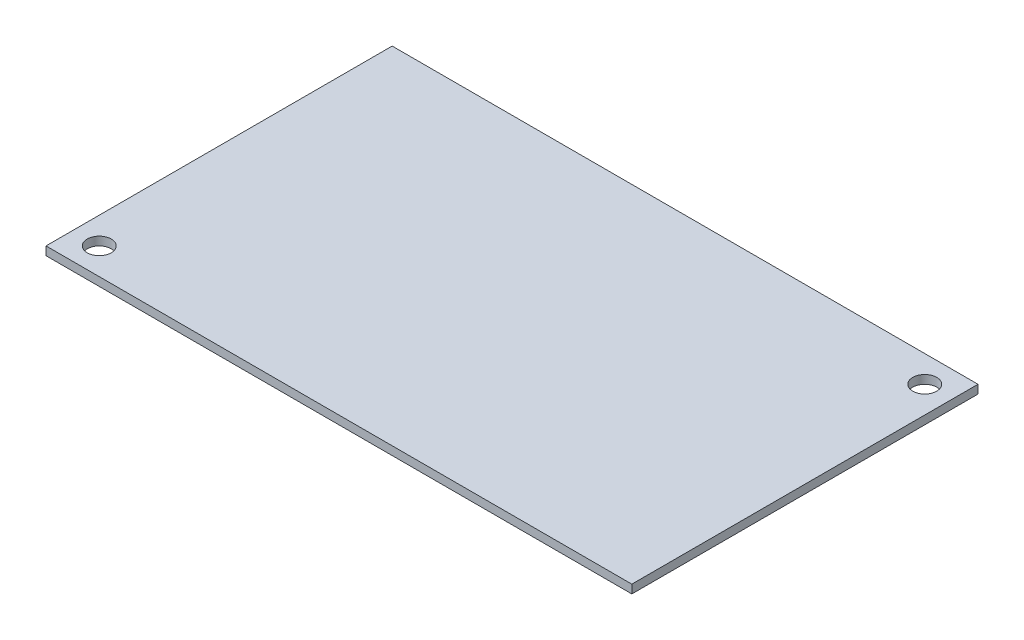
ISO-10303-21;
HEADER;
FILE_DESCRIPTION(('STEP AP214'),'2;1');
FILE_NAME('part.step','',(''),(''),'','','');
FILE_SCHEMA(('AUTOMOTIVE_DESIGN { 1 0 10303 214 1 1 1 1 }'));
ENDSEC;
DATA;
#1=APPLICATION_CONTEXT('core data for automotive mechanical design processes');
#2=APPLICATION_PROTOCOL_DEFINITION('international standard','automotive_design',2000,#1);
#3=PRODUCT_CONTEXT('',#1,'mechanical');
#4=PRODUCT('Part','Part','',(#3));
#5=PRODUCT_RELATED_PRODUCT_CATEGORY('part','',(#4));
#6=PRODUCT_DEFINITION_FORMATION('','',#4);
#7=PRODUCT_DEFINITION_CONTEXT('part definition',#1,'design');
#8=PRODUCT_DEFINITION('design','',#6,#7);
#9=PRODUCT_DEFINITION_SHAPE('','',#8);
#10=(LENGTH_UNIT() NAMED_UNIT(*) SI_UNIT(.MILLI.,.METRE.));
#11=(NAMED_UNIT(*) PLANE_ANGLE_UNIT() SI_UNIT($,.RADIAN.));
#12=(NAMED_UNIT(*) SI_UNIT($,.STERADIAN.) SOLID_ANGLE_UNIT());
#13=UNCERTAINTY_MEASURE_WITH_UNIT(LENGTH_MEASURE(1.E-05),#10,'distance_accuracy_value','');
#14=(GEOMETRIC_REPRESENTATION_CONTEXT(3) GLOBAL_UNCERTAINTY_ASSIGNED_CONTEXT((#13)) GLOBAL_UNIT_ASSIGNED_CONTEXT((#10,
#11,#12)) REPRESENTATION_CONTEXT('',''));
#15=CARTESIAN_POINT('',(0.,0.,0.));
#16=DIRECTION('',(0.,0.,1.));
#17=DIRECTION('',(1.,0.,0.));
#18=AXIS2_PLACEMENT_3D('',#15,#16,#17);
#19=CARTESIAN_POINT('',(0.,1.6,0.));
#20=DIRECTION('',(1.,0.,0.));
#21=DIRECTION('',(0.,0.,-1.));
#22=AXIS2_PLACEMENT_3D('',#19,#20,#21);
#23=PLANE('',#22);
#24=DIRECTION('',(0.,0.,1.));
#25=VECTOR('',#24,1.);
#26=CARTESIAN_POINT('',(0.,0.,0.));
#27=LINE('',#26,#25);
#28=CARTESIAN_POINT('',(0.,0.,-65.));
#29=VERTEX_POINT('',#28);
#30=CARTESIAN_POINT('',(0.,0.,0.));
#31=VERTEX_POINT('',#30);
#32=EDGE_CURVE('E107',#29,#31,#27,.T.);
#33=ORIENTED_EDGE('',*,*,#32,.T.);
#34=DIRECTION('',(0.,-1.,0.));
#35=VECTOR('',#34,1.);
#36=CARTESIAN_POINT('',(0.,1.6,0.));
#37=LINE('',#36,#35);
#38=CARTESIAN_POINT('',(0.,1.6,0.));
#39=VERTEX_POINT('',#38);
#40=EDGE_CURVE('E11',#39,#31,#37,.T.);
#41=ORIENTED_EDGE('',*,*,#40,.F.);
#42=DIRECTION('',(0.,0.,1.));
#43=VECTOR('',#42,1.);
#44=CARTESIAN_POINT('',(0.,1.6,0.));
#45=LINE('',#44,#43);
#46=CARTESIAN_POINT('',(0.,1.6,-65.));
#47=VERTEX_POINT('',#46);
#48=EDGE_CURVE('E91',#47,#39,#45,.T.);
#49=ORIENTED_EDGE('',*,*,#48,.F.);
#50=DIRECTION('',(0.,-1.,0.));
#51=VECTOR('',#50,1.);
#52=CARTESIAN_POINT('',(0.,1.6,-65.));
#53=LINE('',#52,#51);
#54=EDGE_CURVE('E103',#47,#29,#53,.T.);
#55=ORIENTED_EDGE('',*,*,#54,.T.);
#56=EDGE_LOOP('',(#33,#41,#49,#55));
#57=FACE_BOUND('',#56,.T.);
#58=ADVANCED_FACE('F39',(#57),#23,.F.);
#59=CARTESIAN_POINT('',(0.,1.6,0.));
#60=DIRECTION('',(0.,0.,-1.));
#61=DIRECTION('',(-1.,0.,0.));
#62=AXIS2_PLACEMENT_3D('',#59,#60,#61);
#63=PLANE('',#62);
#64=DIRECTION('',(1.,0.,0.));
#65=VECTOR('',#64,1.);
#66=CARTESIAN_POINT('',(0.,0.,0.));
#67=LINE('',#66,#65);
#68=CARTESIAN_POINT('',(110.,0.,0.));
#69=VERTEX_POINT('',#68);
#70=EDGE_CURVE('E96',#31,#69,#67,.T.);
#71=ORIENTED_EDGE('',*,*,#70,.T.);
#72=DIRECTION('',(0.,-1.,0.));
#73=VECTOR('',#72,1.);
#74=CARTESIAN_POINT('',(110.,1.6,0.));
#75=LINE('',#74,#73);
#76=CARTESIAN_POINT('',(110.,1.6,0.));
#77=VERTEX_POINT('',#76);
#78=EDGE_CURVE('E48',#77,#69,#75,.T.);
#79=ORIENTED_EDGE('',*,*,#78,.F.);
#80=DIRECTION('',(1.,0.,0.));
#81=VECTOR('',#80,1.);
#82=CARTESIAN_POINT('',(0.,1.6,0.));
#83=LINE('',#82,#81);
#84=EDGE_CURVE('E86',#39,#77,#83,.T.);
#85=ORIENTED_EDGE('',*,*,#84,.F.);
#86=ORIENTED_EDGE('',*,*,#40,.T.);
#87=EDGE_LOOP('',(#71,#79,#85,#86));
#88=FACE_BOUND('',#87,.T.);
#89=ADVANCED_FACE('F95',(#88),#63,.F.);
#90=CARTESIAN_POINT('',(110.,1.6,0.));
#91=DIRECTION('',(-1.,0.,0.));
#92=DIRECTION('',(0.,0.,1.));
#93=AXIS2_PLACEMENT_3D('',#90,#91,#92);
#94=PLANE('',#93);
#95=DIRECTION('',(0.,0.,-1.));
#96=VECTOR('',#95,1.);
#97=CARTESIAN_POINT('',(110.,0.,0.));
#98=LINE('',#97,#96);
#99=CARTESIAN_POINT('',(110.,0.,-65.));
#100=VERTEX_POINT('',#99);
#101=EDGE_CURVE('E73',#69,#100,#98,.T.);
#102=ORIENTED_EDGE('',*,*,#101,.T.);
#103=DIRECTION('',(0.,-1.,0.));
#104=VECTOR('',#103,1.);
#105=CARTESIAN_POINT('',(110.,1.6,-65.));
#106=LINE('',#105,#104);
#107=CARTESIAN_POINT('',(110.,1.6,-65.));
#108=VERTEX_POINT('',#107);
#109=EDGE_CURVE('E98',#108,#100,#106,.T.);
#110=ORIENTED_EDGE('',*,*,#109,.F.);
#111=DIRECTION('',(0.,0.,-1.));
#112=VECTOR('',#111,1.);
#113=CARTESIAN_POINT('',(110.,1.6,0.));
#114=LINE('',#113,#112);
#115=EDGE_CURVE('E89',#77,#108,#114,.T.);
#116=ORIENTED_EDGE('',*,*,#115,.F.);
#117=ORIENTED_EDGE('',*,*,#78,.T.);
#118=EDGE_LOOP('',(#102,#110,#116,#117));
#119=FACE_BOUND('',#118,.T.);
#120=ADVANCED_FACE('F99',(#119),#94,.F.);
#121=CARTESIAN_POINT('',(0.,1.6,-65.));
#122=DIRECTION('',(0.,0.,1.));
#123=DIRECTION('',(1.,0.,0.));
#124=AXIS2_PLACEMENT_3D('',#121,#122,#123);
#125=PLANE('',#124);
#126=DIRECTION('',(-1.,0.,0.));
#127=VECTOR('',#126,1.);
#128=CARTESIAN_POINT('',(0.,0.,-65.));
#129=LINE('',#128,#127);
#130=EDGE_CURVE('E79',#100,#29,#129,.T.);
#131=ORIENTED_EDGE('',*,*,#130,.T.);
#132=ORIENTED_EDGE('',*,*,#54,.F.);
#133=DIRECTION('',(-1.,0.,0.));
#134=VECTOR('',#133,1.);
#135=CARTESIAN_POINT('',(0.,1.6,-65.));
#136=LINE('',#135,#134);
#137=EDGE_CURVE('E56',#108,#47,#136,.T.);
#138=ORIENTED_EDGE('',*,*,#137,.F.);
#139=ORIENTED_EDGE('',*,*,#109,.T.);
#140=EDGE_LOOP('',(#131,#132,#138,#139));
#141=FACE_BOUND('',#140,.T.);
#142=ADVANCED_FACE('F121',(#141),#125,.F.);
#143=CARTESIAN_POINT('',(0.,1.6,0.));
#144=DIRECTION('',(0.,-1.,0.));
#145=DIRECTION('',(0.,0.,-1.));
#146=AXIS2_PLACEMENT_3D('',#143,#144,#145);
#147=PLANE('',#146);
#148=CARTESIAN_POINT('',(5.,1.6,-5.));
#149=DIRECTION('',(0.,1.,0.));
#150=DIRECTION('',(0.,0.,1.));
#151=AXIS2_PLACEMENT_3D('',#148,#149,#150);
#152=CIRCLE('',#151,2.25);
#153=CARTESIAN_POINT('',(5.,1.6,-2.75));
#154=VERTEX_POINT('',#153);
#155=EDGE_CURVE('E139',#154,#154,#152,.T.);
#156=ORIENTED_EDGE('',*,*,#155,.F.);
#157=EDGE_LOOP('',(#156));
#158=FACE_BOUND('',#157,.T.);
#159=CARTESIAN_POINT('',(105.,1.6,-60.));
#160=DIRECTION('',(0.,1.,0.));
#161=DIRECTION('',(0.,0.,1.));
#162=AXIS2_PLACEMENT_3D('',#159,#160,#161);
#163=CIRCLE('',#162,2.25);
#164=CARTESIAN_POINT('',(105.,1.6,-57.75));
#165=VERTEX_POINT('',#164);
#166=EDGE_CURVE('E131',#165,#165,#163,.T.);
#167=ORIENTED_EDGE('',*,*,#166,.F.);
#168=EDGE_LOOP('',(#167));
#169=FACE_BOUND('',#168,.T.);
#170=ORIENTED_EDGE('',*,*,#48,.T.);
#171=ORIENTED_EDGE('',*,*,#84,.T.);
#172=ORIENTED_EDGE('',*,*,#115,.T.);
#173=ORIENTED_EDGE('',*,*,#137,.T.);
#174=EDGE_LOOP('',(#170,#171,#172,#173));
#175=FACE_BOUND('',#174,.T.);
#176=ADVANCED_FACE('F87',(#158,#169,#175),#147,.F.);
#177=CARTESIAN_POINT('',(0.,0.,0.));
#178=DIRECTION('',(0.,-1.,0.));
#179=DIRECTION('',(0.,0.,-1.));
#180=AXIS2_PLACEMENT_3D('',#177,#178,#179);
#181=PLANE('',#180);
#182=CARTESIAN_POINT('',(5.,0.,-5.));
#183=DIRECTION('',(0.,-1.,0.));
#184=DIRECTION('',(0.,0.,-1.));
#185=AXIS2_PLACEMENT_3D('',#182,#183,#184);
#186=CIRCLE('',#185,2.25);
#187=CARTESIAN_POINT('',(5.,0.,-7.25));
#188=VERTEX_POINT('',#187);
#189=EDGE_CURVE('E135',#188,#188,#186,.T.);
#190=ORIENTED_EDGE('',*,*,#189,.F.);
#191=EDGE_LOOP('',(#190));
#192=FACE_BOUND('',#191,.T.);
#193=CARTESIAN_POINT('',(105.,0.,-60.));
#194=DIRECTION('',(0.,-1.,0.));
#195=DIRECTION('',(0.,0.,-1.));
#196=AXIS2_PLACEMENT_3D('',#193,#194,#195);
#197=CIRCLE('',#196,2.25);
#198=CARTESIAN_POINT('',(105.,0.,-62.25));
#199=VERTEX_POINT('',#198);
#200=EDGE_CURVE('E111',#199,#199,#197,.T.);
#201=ORIENTED_EDGE('',*,*,#200,.F.);
#202=EDGE_LOOP('',(#201));
#203=FACE_BOUND('',#202,.T.);
#204=ORIENTED_EDGE('',*,*,#32,.F.);
#205=ORIENTED_EDGE('',*,*,#130,.F.);
#206=ORIENTED_EDGE('',*,*,#101,.F.);
#207=ORIENTED_EDGE('',*,*,#70,.F.);
#208=EDGE_LOOP('',(#204,#205,#206,#207));
#209=FACE_BOUND('',#208,.T.);
#210=ADVANCED_FACE('F124',(#192,#203,#209),#181,.T.);
#211=CARTESIAN_POINT('',(105.,1.6,-60.));
#212=DIRECTION('',(0.,1.,0.));
#213=DIRECTION('',(0.,0.,1.));
#214=AXIS2_PLACEMENT_3D('',#211,#212,#213);
#215=CYLINDRICAL_SURFACE('',#214,2.25);
#216=ORIENTED_EDGE('',*,*,#200,.T.);
#217=EDGE_LOOP('',(#216));
#218=FACE_BOUND('',#217,.T.);
#219=ORIENTED_EDGE('',*,*,#166,.T.);
#220=EDGE_LOOP('',(#219));
#221=FACE_BOUND('',#220,.T.);
#222=ADVANCED_FACE('F151',(#218,#221),#215,.F.);
#223=CARTESIAN_POINT('',(5.,1.6,-5.));
#224=DIRECTION('',(0.,1.,0.));
#225=DIRECTION('',(0.,0.,1.));
#226=AXIS2_PLACEMENT_3D('',#223,#224,#225);
#227=CYLINDRICAL_SURFACE('',#226,2.25);
#228=ORIENTED_EDGE('',*,*,#189,.T.);
#229=EDGE_LOOP('',(#228));
#230=FACE_BOUND('',#229,.T.);
#231=ORIENTED_EDGE('',*,*,#155,.T.);
#232=EDGE_LOOP('',(#231));
#233=FACE_BOUND('',#232,.T.);
#234=ADVANCED_FACE('F144',(#230,#233),#227,.F.);
#235=CLOSED_SHELL('',(#58,#89,#120,#142,#176,#210,#222,#234));
#236=MANIFOLD_SOLID_BREP('B2',#235);
#237=ADVANCED_BREP_SHAPE_REPRESENTATION('',(#18,#236),#14);
#238=SHAPE_DEFINITION_REPRESENTATION(#9,#237);
ENDSEC;
END-ISO-10303-21;
